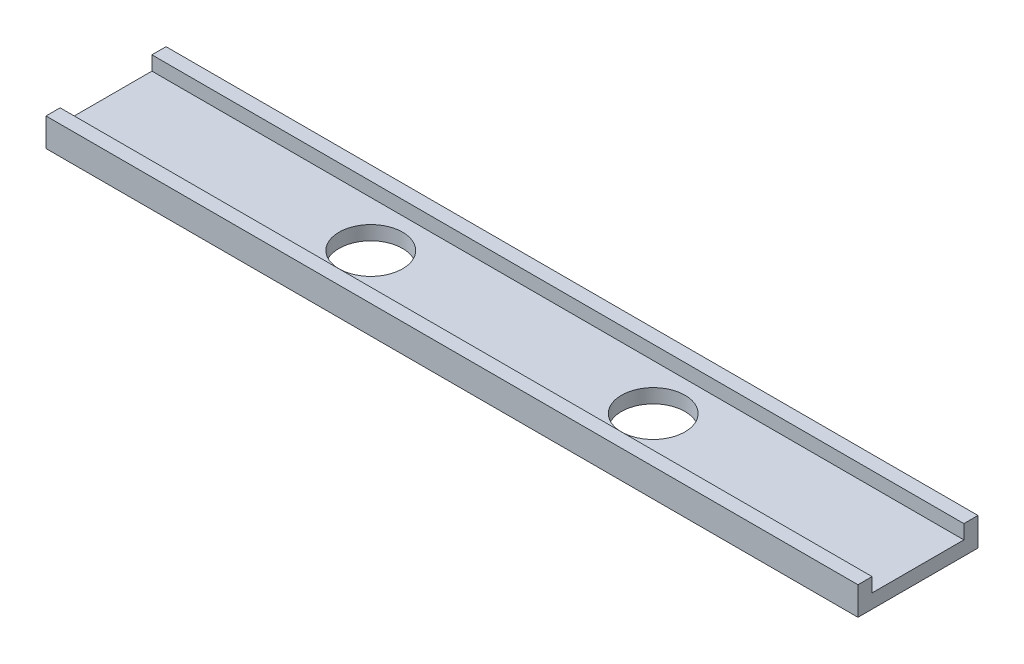
ISO-10303-21;
HEADER;
FILE_DESCRIPTION(('STEP AP214'),'2;1');
FILE_NAME('part.step','',(''),(''),'','','');
FILE_SCHEMA(('AUTOMOTIVE_DESIGN { 1 0 10303 214 1 1 1 1 }'));
ENDSEC;
DATA;
#1=APPLICATION_CONTEXT('core data for automotive mechanical design processes');
#2=APPLICATION_PROTOCOL_DEFINITION('international standard','automotive_design',2000,#1);
#3=PRODUCT_CONTEXT('',#1,'mechanical');
#4=PRODUCT('Part','Part','',(#3));
#5=PRODUCT_RELATED_PRODUCT_CATEGORY('part','',(#4));
#6=PRODUCT_DEFINITION_FORMATION('','',#4);
#7=PRODUCT_DEFINITION_CONTEXT('part definition',#1,'design');
#8=PRODUCT_DEFINITION('design','',#6,#7);
#9=PRODUCT_DEFINITION_SHAPE('','',#8);
#10=(LENGTH_UNIT() NAMED_UNIT(*) SI_UNIT(.MILLI.,.METRE.));
#11=(NAMED_UNIT(*) PLANE_ANGLE_UNIT() SI_UNIT($,.RADIAN.));
#12=(NAMED_UNIT(*) SI_UNIT($,.STERADIAN.) SOLID_ANGLE_UNIT());
#13=UNCERTAINTY_MEASURE_WITH_UNIT(LENGTH_MEASURE(1.E-05),#10,'distance_accuracy_value','');
#14=(GEOMETRIC_REPRESENTATION_CONTEXT(3) GLOBAL_UNCERTAINTY_ASSIGNED_CONTEXT((#13)) GLOBAL_UNIT_ASSIGNED_CONTEXT((#10,
#11,#12)) REPRESENTATION_CONTEXT('',''));
#15=CARTESIAN_POINT('',(0.,0.,0.));
#16=DIRECTION('',(0.,0.,1.));
#17=DIRECTION('',(1.,0.,0.));
#18=AXIS2_PLACEMENT_3D('',#15,#16,#17);
#19=CARTESIAN_POINT('',(-58.464841236129,4.,-0.5));
#20=DIRECTION('',(0.,-1.,0.));
#21=DIRECTION('',(0.,0.,-1.));
#22=AXIS2_PLACEMENT_3D('',#19,#20,#21);
#23=PLANE('',#22);
#24=DIRECTION('',(-1.,0.,0.));
#25=VECTOR('',#24,1.);
#26=CARTESIAN_POINT('',(-58.464841236129,4.00000000000001,-4.5));
#27=LINE('',#26,#25);
#28=CARTESIAN_POINT('',(0.,4.00000000000001,-4.5));
#29=VERTEX_POINT('',#28);
#30=CARTESIAN_POINT('',(-230.,4.00000000000001,-4.5));
#31=VERTEX_POINT('',#30);
#32=EDGE_CURVE('E65',#29,#31,#27,.T.);
#33=ORIENTED_EDGE('',*,*,#32,.T.);
#34=DIRECTION('',(0.,0.,-1.));
#35=VECTOR('',#34,1.);
#36=CARTESIAN_POINT('',(-230.,4.,-0.499999999999924));
#37=LINE('',#36,#35);
#38=CARTESIAN_POINT('',(-230.,4.,-0.499999999999924));
#39=VERTEX_POINT('',#38);
#40=EDGE_CURVE('E159',#39,#31,#37,.T.);
#41=ORIENTED_EDGE('',*,*,#40,.F.);
#42=DIRECTION('',(-1.,0.,0.));
#43=VECTOR('',#42,1.);
#44=CARTESIAN_POINT('',(-58.464841236129,4.,-0.5));
#45=LINE('',#44,#43);
#46=CARTESIAN_POINT('',(0.,4.00000000000001,-0.499999999999924));
#47=VERTEX_POINT('',#46);
#48=EDGE_CURVE('E49',#47,#39,#45,.T.);
#49=ORIENTED_EDGE('',*,*,#48,.F.);
#50=DIRECTION('',(0.,0.,-1.));
#51=VECTOR('',#50,1.);
#52=CARTESIAN_POINT('',(0.,4.00000000000001,-0.499999999999924));
#53=LINE('',#52,#51);
#54=EDGE_CURVE('E126',#47,#29,#53,.T.);
#55=ORIENTED_EDGE('',*,*,#54,.T.);
#56=EDGE_LOOP('',(#33,#41,#49,#55));
#57=FACE_BOUND('',#56,.T.);
#58=ADVANCED_FACE('F41',(#57),#23,.F.);
#59=CARTESIAN_POINT('',(-58.464841236129,-4.,-4.50000000000001));
#60=DIRECTION('',(0.,1.,0.));
#61=DIRECTION('',(0.,0.,1.));
#62=AXIS2_PLACEMENT_3D('',#59,#60,#61);
#63=PLANE('',#62);
#64=CARTESIAN_POINT('',(-155.,-4.,12.5));
#65=DIRECTION('',(0.,-1.,0.));
#66=DIRECTION('',(0.,0.,1.));
#67=AXIS2_PLACEMENT_3D('',#64,#65,#66);
#68=CIRCLE('',#67,9.00000000000001);
#69=CARTESIAN_POINT('',(-155.,-4.,21.5));
#70=VERTEX_POINT('',#69);
#71=EDGE_CURVE('E163',#70,#70,#68,.T.);
#72=ORIENTED_EDGE('',*,*,#71,.F.);
#73=EDGE_LOOP('',(#72));
#74=FACE_BOUND('',#73,.T.);
#75=CARTESIAN_POINT('',(-75.,-4.,12.5));
#76=DIRECTION('',(0.,-1.,0.));
#77=DIRECTION('',(0.,0.,-1.));
#78=AXIS2_PLACEMENT_3D('',#75,#76,#77);
#79=CIRCLE('',#78,9.);
#80=CARTESIAN_POINT('',(-75.,-4.,3.5));
#81=VERTEX_POINT('',#80);
#82=EDGE_CURVE('E166',#81,#81,#79,.T.);
#83=ORIENTED_EDGE('',*,*,#82,.F.);
#84=EDGE_LOOP('',(#83));
#85=FACE_BOUND('',#84,.T.);
#86=DIRECTION('',(-1.,0.,0.));
#87=VECTOR('',#86,1.);
#88=CARTESIAN_POINT('',(-58.464841236129,-4.,29.5));
#89=LINE('',#88,#87);
#90=CARTESIAN_POINT('',(0.,-3.99999999999999,29.5));
#91=VERTEX_POINT('',#90);
#92=CARTESIAN_POINT('',(-230.,-4.,29.5));
#93=VERTEX_POINT('',#92);
#94=EDGE_CURVE('E114',#91,#93,#89,.T.);
#95=ORIENTED_EDGE('',*,*,#94,.T.);
#96=DIRECTION('',(0.,0.,1.));
#97=VECTOR('',#96,1.);
#98=CARTESIAN_POINT('',(-230.,-4.,-4.5));
#99=LINE('',#98,#97);
#100=CARTESIAN_POINT('',(-230.,-4.,-4.5));
#101=VERTEX_POINT('',#100);
#102=EDGE_CURVE('E113',#101,#93,#99,.T.);
#103=ORIENTED_EDGE('',*,*,#102,.F.);
#104=DIRECTION('',(-1.,0.,0.));
#105=VECTOR('',#104,1.);
#106=CARTESIAN_POINT('',(-58.464841236129,-4.,-4.50000000000001));
#107=LINE('',#106,#105);
#108=CARTESIAN_POINT('',(0.,-3.99999999999999,-4.5));
#109=VERTEX_POINT('',#108);
#110=EDGE_CURVE('E57',#109,#101,#107,.T.);
#111=ORIENTED_EDGE('',*,*,#110,.F.);
#112=DIRECTION('',(0.,0.,1.));
#113=VECTOR('',#112,1.);
#114=CARTESIAN_POINT('',(0.,-3.99999999999999,-4.5));
#115=LINE('',#114,#113);
#116=EDGE_CURVE('E110',#109,#91,#115,.T.);
#117=ORIENTED_EDGE('',*,*,#116,.T.);
#118=EDGE_LOOP('',(#95,#103,#111,#117));
#119=FACE_BOUND('',#118,.T.);
#120=ADVANCED_FACE('F109',(#74,#85,#119),#63,.F.);
#121=CARTESIAN_POINT('',(-58.464841236129,4.,29.5));
#122=DIRECTION('',(0.,-1.,0.));
#123=DIRECTION('',(1.,0.,0.));
#124=AXIS2_PLACEMENT_3D('',#121,#122,#123);
#125=PLANE('',#124);
#126=DIRECTION('',(-1.,0.,0.));
#127=VECTOR('',#126,1.);
#128=CARTESIAN_POINT('',(-58.464841236129,4.,25.5));
#129=LINE('',#128,#127);
#130=CARTESIAN_POINT('',(0.,4.,25.5));
#131=VERTEX_POINT('',#130);
#132=CARTESIAN_POINT('',(-230.,4.,25.5));
#133=VERTEX_POINT('',#132);
#134=EDGE_CURVE('E172',#131,#133,#129,.T.);
#135=ORIENTED_EDGE('',*,*,#134,.T.);
#136=DIRECTION('',(0.,0.,-1.));
#137=VECTOR('',#136,1.);
#138=CARTESIAN_POINT('',(-230.,4.,29.5));
#139=LINE('',#138,#137);
#140=CARTESIAN_POINT('',(-230.,4.,29.5));
#141=VERTEX_POINT('',#140);
#142=EDGE_CURVE('E147',#141,#133,#139,.T.);
#143=ORIENTED_EDGE('',*,*,#142,.F.);
#144=DIRECTION('',(-1.,0.,0.));
#145=VECTOR('',#144,1.);
#146=CARTESIAN_POINT('',(-58.464841236129,4.,29.5));
#147=LINE('',#146,#145);
#148=CARTESIAN_POINT('',(0.,4.00000000000001,29.5));
#149=VERTEX_POINT('',#148);
#150=EDGE_CURVE('E174',#149,#141,#147,.T.);
#151=ORIENTED_EDGE('',*,*,#150,.F.);
#152=DIRECTION('',(0.,0.,-1.));
#153=VECTOR('',#152,1.);
#154=CARTESIAN_POINT('',(0.,4.00000000000001,29.5));
#155=LINE('',#154,#153);
#156=EDGE_CURVE('E139',#149,#131,#155,.T.);
#157=ORIENTED_EDGE('',*,*,#156,.T.);
#158=EDGE_LOOP('',(#135,#143,#151,#157));
#159=FACE_BOUND('',#158,.T.);
#160=ADVANCED_FACE('F206',(#159),#125,.F.);
#161=CARTESIAN_POINT('',(-58.464841236129,0.,25.5));
#162=DIRECTION('',(0.,-1.,0.));
#163=DIRECTION('',(0.,0.,-1.));
#164=AXIS2_PLACEMENT_3D('',#161,#162,#163);
#165=PLANE('',#164);
#166=CARTESIAN_POINT('',(-155.,0.,12.5));
#167=DIRECTION('',(0.,-1.,0.));
#168=DIRECTION('',(0.,0.,-1.));
#169=AXIS2_PLACEMENT_3D('',#166,#167,#168);
#170=CIRCLE('',#169,9.00000000000001);
#171=CARTESIAN_POINT('',(-155.,0.,3.49999999999998));
#172=VERTEX_POINT('',#171);
#173=EDGE_CURVE('E44',#172,#172,#170,.T.);
#174=ORIENTED_EDGE('',*,*,#173,.T.);
#175=EDGE_LOOP('',(#174));
#176=FACE_BOUND('',#175,.T.);
#177=CARTESIAN_POINT('',(-75.,0.,12.5));
#178=DIRECTION('',(0.,-1.,0.));
#179=DIRECTION('',(0.,0.,-1.));
#180=AXIS2_PLACEMENT_3D('',#177,#178,#179);
#181=CIRCLE('',#180,9.);
#182=CARTESIAN_POINT('',(-75.,0.,3.5));
#183=VERTEX_POINT('',#182);
#184=EDGE_CURVE('E169',#183,#183,#181,.T.);
#185=ORIENTED_EDGE('',*,*,#184,.T.);
#186=EDGE_LOOP('',(#185));
#187=FACE_BOUND('',#186,.T.);
#188=DIRECTION('',(-1.,0.,0.));
#189=VECTOR('',#188,1.);
#190=CARTESIAN_POINT('',(-58.464841236129,0.,-0.499999999999997));
#191=LINE('',#190,#189);
#192=CARTESIAN_POINT('',(0.,0.,-0.499999999999997));
#193=VERTEX_POINT('',#192);
#194=CARTESIAN_POINT('',(-230.,0.,-0.499999999999997));
#195=VERTEX_POINT('',#194);
#196=EDGE_CURVE('E11',#193,#195,#191,.T.);
#197=ORIENTED_EDGE('',*,*,#196,.T.);
#198=DIRECTION('',(0.,0.,-1.));
#199=VECTOR('',#198,1.);
#200=CARTESIAN_POINT('',(-230.,0.,25.5));
#201=LINE('',#200,#199);
#202=CARTESIAN_POINT('',(-230.,0.,25.5));
#203=VERTEX_POINT('',#202);
#204=EDGE_CURVE('E153',#203,#195,#201,.T.);
#205=ORIENTED_EDGE('',*,*,#204,.F.);
#206=DIRECTION('',(-1.,0.,0.));
#207=VECTOR('',#206,1.);
#208=CARTESIAN_POINT('',(-58.464841236129,0.,25.5));
#209=LINE('',#208,#207);
#210=CARTESIAN_POINT('',(0.,0.,25.5));
#211=VERTEX_POINT('',#210);
#212=EDGE_CURVE('E170',#211,#203,#209,.T.);
#213=ORIENTED_EDGE('',*,*,#212,.F.);
#214=DIRECTION('',(0.,0.,-1.));
#215=VECTOR('',#214,1.);
#216=CARTESIAN_POINT('',(0.,0.,25.5));
#217=LINE('',#216,#215);
#218=EDGE_CURVE('E133',#211,#193,#217,.T.);
#219=ORIENTED_EDGE('',*,*,#218,.T.);
#220=EDGE_LOOP('',(#197,#205,#213,#219));
#221=FACE_BOUND('',#220,.T.);
#222=ADVANCED_FACE('F181',(#176,#187,#221),#165,.F.);
#223=CARTESIAN_POINT('',(-11.5834042644007,1.35963832883271,-0.499999999999997));
#224=DIRECTION('',(0.,0.,1.));
#225=DIRECTION('',(0.,-1.,0.));
#226=AXIS2_PLACEMENT_3D('',#223,#224,#225);
#227=PLANE('',#226);
#228=ORIENTED_EDGE('',*,*,#48,.T.);
#229=DIRECTION('',(0.,1.,0.));
#230=VECTOR('',#229,1.);
#231=CARTESIAN_POINT('',(-230.,0.,-0.499999999999997));
#232=LINE('',#231,#230);
#233=EDGE_CURVE('E156',#195,#39,#232,.T.);
#234=ORIENTED_EDGE('',*,*,#233,.F.);
#235=ORIENTED_EDGE('',*,*,#196,.F.);
#236=DIRECTION('',(0.,1.,0.));
#237=VECTOR('',#236,1.);
#238=CARTESIAN_POINT('',(0.,0.,-0.499999999999997));
#239=LINE('',#238,#237);
#240=EDGE_CURVE('E128',#193,#47,#239,.T.);
#241=ORIENTED_EDGE('',*,*,#240,.T.);
#242=EDGE_LOOP('',(#228,#234,#235,#241));
#243=FACE_BOUND('',#242,.T.);
#244=ADVANCED_FACE('F217',(#243),#227,.T.);
#245=CARTESIAN_POINT('',(-9.0122538256545,4.42381610130862,-4.5));
#246=DIRECTION('',(0.,0.,-1.));
#247=DIRECTION('',(0.,1.,0.));
#248=AXIS2_PLACEMENT_3D('',#245,#246,#247);
#249=PLANE('',#248);
#250=ORIENTED_EDGE('',*,*,#110,.T.);
#251=DIRECTION('',(0.,-1.,0.));
#252=VECTOR('',#251,1.);
#253=CARTESIAN_POINT('',(-230.,4.00000000000001,-4.5));
#254=LINE('',#253,#252);
#255=EDGE_CURVE('E161',#31,#101,#254,.T.);
#256=ORIENTED_EDGE('',*,*,#255,.F.);
#257=ORIENTED_EDGE('',*,*,#32,.F.);
#258=DIRECTION('',(0.,-1.,0.));
#259=VECTOR('',#258,1.);
#260=CARTESIAN_POINT('',(0.,4.00000000000001,-4.5));
#261=LINE('',#260,#259);
#262=EDGE_CURVE('E120',#29,#109,#261,.T.);
#263=ORIENTED_EDGE('',*,*,#262,.T.);
#264=EDGE_LOOP('',(#250,#256,#257,#263));
#265=FACE_BOUND('',#264,.T.);
#266=ADVANCED_FACE('F125',(#265),#249,.T.);
#267=CARTESIAN_POINT('',(-14.1545547031468,-1.70453944364321,29.5));
#268=DIRECTION('',(0.,0.,1.));
#269=DIRECTION('',(0.,-1.,0.));
#270=AXIS2_PLACEMENT_3D('',#267,#268,#269);
#271=PLANE('',#270);
#272=ORIENTED_EDGE('',*,*,#150,.T.);
#273=DIRECTION('',(0.,1.,0.));
#274=VECTOR('',#273,1.);
#275=CARTESIAN_POINT('',(-230.,-4.,29.5));
#276=LINE('',#275,#274);
#277=EDGE_CURVE('E144',#93,#141,#276,.T.);
#278=ORIENTED_EDGE('',*,*,#277,.F.);
#279=ORIENTED_EDGE('',*,*,#94,.F.);
#280=DIRECTION('',(0.,1.,0.));
#281=VECTOR('',#280,1.);
#282=CARTESIAN_POINT('',(0.,-3.99999999999999,29.5));
#283=LINE('',#282,#281);
#284=EDGE_CURVE('E123',#91,#149,#283,.T.);
#285=ORIENTED_EDGE('',*,*,#284,.T.);
#286=EDGE_LOOP('',(#272,#278,#279,#285));
#287=FACE_BOUND('',#286,.T.);
#288=ADVANCED_FACE('F197',(#287),#271,.T.);
#289=CARTESIAN_POINT('',(-9.0122538256545,4.42381610130862,25.5));
#290=DIRECTION('',(0.,0.,-1.));
#291=DIRECTION('',(-1.,0.,0.));
#292=AXIS2_PLACEMENT_3D('',#289,#290,#291);
#293=PLANE('',#292);
#294=ORIENTED_EDGE('',*,*,#212,.T.);
#295=DIRECTION('',(0.,-1.,0.));
#296=VECTOR('',#295,1.);
#297=CARTESIAN_POINT('',(-230.,4.,25.5));
#298=LINE('',#297,#296);
#299=EDGE_CURVE('E150',#133,#203,#298,.T.);
#300=ORIENTED_EDGE('',*,*,#299,.F.);
#301=ORIENTED_EDGE('',*,*,#134,.F.);
#302=DIRECTION('',(0.,-1.,0.));
#303=VECTOR('',#302,1.);
#304=CARTESIAN_POINT('',(0.,4.,25.5));
#305=LINE('',#304,#303);
#306=EDGE_CURVE('E136',#131,#211,#305,.T.);
#307=ORIENTED_EDGE('',*,*,#306,.T.);
#308=EDGE_LOOP('',(#294,#300,#301,#307));
#309=FACE_BOUND('',#308,.T.);
#310=ADVANCED_FACE('F187',(#309),#293,.T.);
#311=CARTESIAN_POINT('',(-75.,8.16710501140499,12.5));
#312=DIRECTION('',(0.,-1.,0.));
#313=DIRECTION('',(0.,0.,-1.));
#314=AXIS2_PLACEMENT_3D('',#311,#312,#313);
#315=CYLINDRICAL_SURFACE('',#314,9.);
#316=ORIENTED_EDGE('',*,*,#82,.T.);
#317=EDGE_LOOP('',(#316));
#318=FACE_BOUND('',#317,.T.);
#319=ORIENTED_EDGE('',*,*,#184,.F.);
#320=EDGE_LOOP('',(#319));
#321=FACE_BOUND('',#320,.T.);
#322=ADVANCED_FACE('F184',(#318,#321),#315,.F.);
#323=CARTESIAN_POINT('',(-155.,8.16710501140499,12.5));
#324=DIRECTION('',(0.,-1.,0.));
#325=DIRECTION('',(0.,0.,-1.));
#326=AXIS2_PLACEMENT_3D('',#323,#324,#325);
#327=CYLINDRICAL_SURFACE('',#326,9.00000000000001);
#328=ORIENTED_EDGE('',*,*,#71,.T.);
#329=EDGE_LOOP('',(#328));
#330=FACE_BOUND('',#329,.T.);
#331=ORIENTED_EDGE('',*,*,#173,.F.);
#332=EDGE_LOOP('',(#331));
#333=FACE_BOUND('',#332,.T.);
#334=ADVANCED_FACE('F186',(#330,#333),#327,.F.);
#335=CARTESIAN_POINT('',(-230.,-4.,29.5));
#336=DIRECTION('',(-1.,0.,0.));
#337=DIRECTION('',(0.,0.,1.));
#338=AXIS2_PLACEMENT_3D('',#335,#336,#337);
#339=PLANE('',#338);
#340=ORIENTED_EDGE('',*,*,#102,.T.);
#341=ORIENTED_EDGE('',*,*,#277,.T.);
#342=ORIENTED_EDGE('',*,*,#142,.T.);
#343=ORIENTED_EDGE('',*,*,#299,.T.);
#344=ORIENTED_EDGE('',*,*,#204,.T.);
#345=ORIENTED_EDGE('',*,*,#233,.T.);
#346=ORIENTED_EDGE('',*,*,#40,.T.);
#347=ORIENTED_EDGE('',*,*,#255,.T.);
#348=EDGE_LOOP('',(#340,#341,#342,#343,#344,#345,#346,#347));
#349=FACE_BOUND('',#348,.T.);
#350=ADVANCED_FACE('F193',(#349),#339,.T.);
#351=CARTESIAN_POINT('',(0.,-3.99999999999999,29.5));
#352=DIRECTION('',(1.,0.,0.));
#353=DIRECTION('',(0.,0.,1.));
#354=AXIS2_PLACEMENT_3D('',#351,#352,#353);
#355=PLANE('',#354);
#356=ORIENTED_EDGE('',*,*,#116,.F.);
#357=ORIENTED_EDGE('',*,*,#262,.F.);
#358=ORIENTED_EDGE('',*,*,#54,.F.);
#359=ORIENTED_EDGE('',*,*,#240,.F.);
#360=ORIENTED_EDGE('',*,*,#218,.F.);
#361=ORIENTED_EDGE('',*,*,#306,.F.);
#362=ORIENTED_EDGE('',*,*,#156,.F.);
#363=ORIENTED_EDGE('',*,*,#284,.F.);
#364=EDGE_LOOP('',(#356,#357,#358,#359,#360,#361,#362,#363));
#365=FACE_BOUND('',#364,.T.);
#366=ADVANCED_FACE('F118',(#365),#355,.T.);
#367=CLOSED_SHELL('',(#58,#120,#160,#222,#244,#266,#288,#310,#322,#334,#350,#366));
#368=MANIFOLD_SOLID_BREP('B2',#367);
#369=ADVANCED_BREP_SHAPE_REPRESENTATION('',(#18,#368),#14);
#370=SHAPE_DEFINITION_REPRESENTATION(#9,#369);
ENDSEC;
END-ISO-10303-21;
